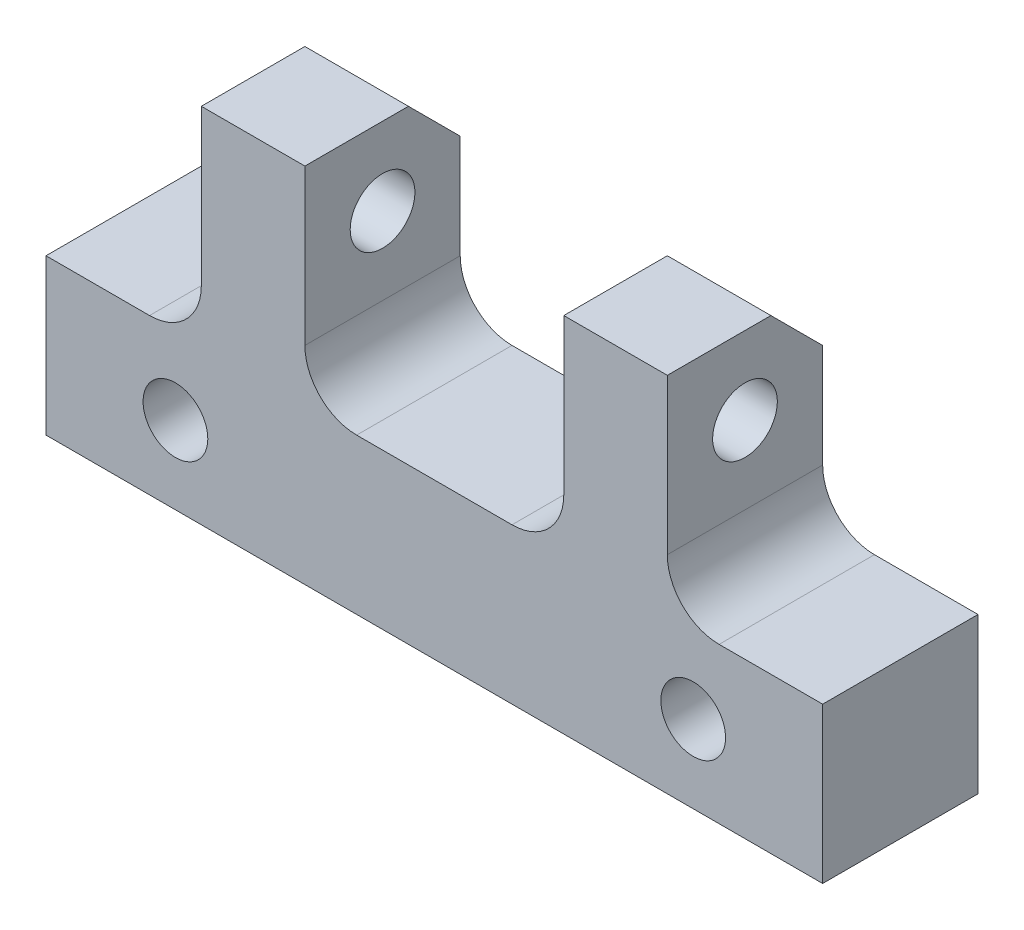
ISO-10303-21;
HEADER;
FILE_DESCRIPTION(('STEP AP214'),'2;1');
FILE_NAME('part.step','',(''),(''),'','','');
FILE_SCHEMA(('AUTOMOTIVE_DESIGN { 1 0 10303 214 1 1 1 1 }'));
ENDSEC;
DATA;
#1=APPLICATION_CONTEXT('core data for automotive mechanical design processes');
#2=APPLICATION_PROTOCOL_DEFINITION('international standard','automotive_design',2000,#1);
#3=PRODUCT_CONTEXT('',#1,'mechanical');
#4=PRODUCT('Part','Part','',(#3));
#5=PRODUCT_RELATED_PRODUCT_CATEGORY('part','',(#4));
#6=PRODUCT_DEFINITION_FORMATION('','',#4);
#7=PRODUCT_DEFINITION_CONTEXT('part definition',#1,'design');
#8=PRODUCT_DEFINITION('design','',#6,#7);
#9=PRODUCT_DEFINITION_SHAPE('','',#8);
#10=(LENGTH_UNIT() NAMED_UNIT(*) SI_UNIT(.MILLI.,.METRE.));
#11=(NAMED_UNIT(*) PLANE_ANGLE_UNIT() SI_UNIT($,.RADIAN.));
#12=(NAMED_UNIT(*) SI_UNIT($,.STERADIAN.) SOLID_ANGLE_UNIT());
#13=UNCERTAINTY_MEASURE_WITH_UNIT(LENGTH_MEASURE(1.E-05),#10,'distance_accuracy_value','');
#14=(GEOMETRIC_REPRESENTATION_CONTEXT(3) GLOBAL_UNCERTAINTY_ASSIGNED_CONTEXT((#13)) GLOBAL_UNIT_ASSIGNED_CONTEXT((#10,
#11,#12)) REPRESENTATION_CONTEXT('',''));
#15=CARTESIAN_POINT('',(0.,0.,0.));
#16=DIRECTION('',(0.,0.,1.));
#17=DIRECTION('',(1.,0.,0.));
#18=AXIS2_PLACEMENT_3D('',#15,#16,#17);
#19=CARTESIAN_POINT('',(0.,0.,6.));
#20=DIRECTION('',(0.,0.,1.));
#21=DIRECTION('',(1.,0.,0.));
#22=AXIS2_PLACEMENT_3D('',#19,#20,#21);
#23=PLANE('',#22);
#24=CARTESIAN_POINT('',(-10.,-3.,6.));
#25=DIRECTION('',(0.,0.,1.));
#26=DIRECTION('',(1.,0.,0.));
#27=AXIS2_PLACEMENT_3D('',#24,#25,#26);
#28=CIRCLE('',#27,1.25);
#29=CARTESIAN_POINT('',(-8.75,-3.,6.));
#30=VERTEX_POINT('',#29);
#31=EDGE_CURVE('E284',#30,#30,#28,.T.);
#32=ORIENTED_EDGE('',*,*,#31,.F.);
#33=EDGE_LOOP('',(#32));
#34=FACE_BOUND('',#33,.T.);
#35=DIRECTION('',(0.,-1.,0.));
#36=VECTOR('',#35,1.);
#37=CARTESIAN_POINT('',(-15.,0.,6.));
#38=LINE('',#37,#36);
#39=CARTESIAN_POINT('',(-15.,0.,6.));
#40=VERTEX_POINT('',#39);
#41=CARTESIAN_POINT('',(-15.,-6.,6.));
#42=VERTEX_POINT('',#41);
#43=EDGE_CURVE('E174',#40,#42,#38,.T.);
#44=ORIENTED_EDGE('',*,*,#43,.T.);
#45=DIRECTION('',(1.,0.,0.));
#46=VECTOR('',#45,1.);
#47=CARTESIAN_POINT('',(-15.,-6.,6.));
#48=LINE('',#47,#46);
#49=CARTESIAN_POINT('',(15.,-6.,6.));
#50=VERTEX_POINT('',#49);
#51=EDGE_CURVE('E164',#42,#50,#48,.T.);
#52=ORIENTED_EDGE('',*,*,#51,.T.);
#53=DIRECTION('',(0.,1.,0.));
#54=VECTOR('',#53,1.);
#55=CARTESIAN_POINT('',(15.,0.,6.));
#56=LINE('',#55,#54);
#57=CARTESIAN_POINT('',(15.,0.,6.));
#58=VERTEX_POINT('',#57);
#59=EDGE_CURVE('E173',#50,#58,#56,.T.);
#60=ORIENTED_EDGE('',*,*,#59,.T.);
#61=DIRECTION('',(-1.,0.,0.));
#62=VECTOR('',#61,1.);
#63=CARTESIAN_POINT('',(9.,0.,6.));
#64=LINE('',#63,#62);
#65=CARTESIAN_POINT('',(11.,0.,6.));
#66=VERTEX_POINT('',#65);
#67=EDGE_CURVE('E318',#58,#66,#64,.T.);
#68=ORIENTED_EDGE('',*,*,#67,.T.);
#69=CARTESIAN_POINT('',(11.,2.,6.));
#70=DIRECTION('',(0.,0.,1.));
#71=DIRECTION('',(1.,0.,0.));
#72=AXIS2_PLACEMENT_3D('',#69,#70,#71);
#73=CIRCLE('',#72,2.);
#74=CARTESIAN_POINT('',(9.,2.,6.));
#75=VERTEX_POINT('',#74);
#76=EDGE_CURVE('E238',#66,#75,#73,.F.);
#77=ORIENTED_EDGE('',*,*,#76,.T.);
#78=DIRECTION('',(0.,1.,0.));
#79=VECTOR('',#78,1.);
#80=CARTESIAN_POINT('',(9.,8.,6.));
#81=LINE('',#80,#79);
#82=CARTESIAN_POINT('',(9.,8.,6.));
#83=VERTEX_POINT('',#82);
#84=EDGE_CURVE('E330',#75,#83,#81,.T.);
#85=ORIENTED_EDGE('',*,*,#84,.T.);
#86=DIRECTION('',(-1.,0.,0.));
#87=VECTOR('',#86,1.);
#88=CARTESIAN_POINT('',(5.,8.,6.));
#89=LINE('',#88,#87);
#90=CARTESIAN_POINT('',(5.,8.,6.));
#91=VERTEX_POINT('',#90);
#92=EDGE_CURVE('E332',#83,#91,#89,.T.);
#93=ORIENTED_EDGE('',*,*,#92,.T.);
#94=DIRECTION('',(0.,-1.,0.));
#95=VECTOR('',#94,1.);
#96=CARTESIAN_POINT('',(5.,8.,6.));
#97=LINE('',#96,#95);
#98=CARTESIAN_POINT('',(5.,2.,6.));
#99=VERTEX_POINT('',#98);
#100=EDGE_CURVE('E274',#91,#99,#97,.T.);
#101=ORIENTED_EDGE('',*,*,#100,.T.);
#102=CARTESIAN_POINT('',(3.,2.,6.));
#103=DIRECTION('',(0.,0.,1.));
#104=DIRECTION('',(1.,0.,0.));
#105=AXIS2_PLACEMENT_3D('',#102,#103,#104);
#106=CIRCLE('',#105,2.);
#107=CARTESIAN_POINT('',(3.,0.,6.));
#108=VERTEX_POINT('',#107);
#109=EDGE_CURVE('E246',#99,#108,#106,.F.);
#110=ORIENTED_EDGE('',*,*,#109,.T.);
#111=DIRECTION('',(-1.,0.,0.));
#112=VECTOR('',#111,1.);
#113=CARTESIAN_POINT('',(5.,0.,6.));
#114=LINE('',#113,#112);
#115=CARTESIAN_POINT('',(-3.,0.,6.));
#116=VERTEX_POINT('',#115);
#117=EDGE_CURVE('E270',#108,#116,#114,.T.);
#118=ORIENTED_EDGE('',*,*,#117,.T.);
#119=CARTESIAN_POINT('',(-3.,2.,6.));
#120=DIRECTION('',(0.,0.,1.));
#121=DIRECTION('',(1.,0.,0.));
#122=AXIS2_PLACEMENT_3D('',#119,#120,#121);
#123=CIRCLE('',#122,2.);
#124=CARTESIAN_POINT('',(-5.,2.,6.));
#125=VERTEX_POINT('',#124);
#126=EDGE_CURVE('E11',#116,#125,#123,.F.);
#127=ORIENTED_EDGE('',*,*,#126,.T.);
#128=DIRECTION('',(0.,1.,0.));
#129=VECTOR('',#128,1.);
#130=CARTESIAN_POINT('',(-5.,0.,6.));
#131=LINE('',#130,#129);
#132=CARTESIAN_POINT('',(-5.,8.,6.));
#133=VERTEX_POINT('',#132);
#134=EDGE_CURVE('E265',#125,#133,#131,.T.);
#135=ORIENTED_EDGE('',*,*,#134,.T.);
#136=DIRECTION('',(-1.,0.,0.));
#137=VECTOR('',#136,1.);
#138=CARTESIAN_POINT('',(-5.,8.,6.));
#139=LINE('',#138,#137);
#140=CARTESIAN_POINT('',(-9.,8.,6.));
#141=VERTEX_POINT('',#140);
#142=EDGE_CURVE('E269',#133,#141,#139,.T.);
#143=ORIENTED_EDGE('',*,*,#142,.T.);
#144=DIRECTION('',(0.,-1.,0.));
#145=VECTOR('',#144,1.);
#146=CARTESIAN_POINT('',(-9.,8.,6.));
#147=LINE('',#146,#145);
#148=CARTESIAN_POINT('',(-9.,2.,6.));
#149=VERTEX_POINT('',#148);
#150=EDGE_CURVE('E272',#141,#149,#147,.T.);
#151=ORIENTED_EDGE('',*,*,#150,.T.);
#152=CARTESIAN_POINT('',(-11.,2.,6.));
#153=DIRECTION('',(0.,0.,1.));
#154=DIRECTION('',(1.,0.,0.));
#155=AXIS2_PLACEMENT_3D('',#152,#153,#154);
#156=CIRCLE('',#155,2.);
#157=CARTESIAN_POINT('',(-11.,0.,6.));
#158=VERTEX_POINT('',#157);
#159=EDGE_CURVE('E242',#149,#158,#156,.F.);
#160=ORIENTED_EDGE('',*,*,#159,.T.);
#161=DIRECTION('',(-1.,0.,0.));
#162=VECTOR('',#161,1.);
#163=CARTESIAN_POINT('',(-9.,0.,6.));
#164=LINE('',#163,#162);
#165=EDGE_CURVE('E179',#158,#40,#164,.T.);
#166=ORIENTED_EDGE('',*,*,#165,.T.);
#167=EDGE_LOOP('',(#44,#52,#60,#68,#77,#85,#93,#101,#110,#118,#127,#135,#143,#151,#160,#166));
#168=FACE_BOUND('',#167,.T.);
#169=CARTESIAN_POINT('',(10.,-3.,6.));
#170=DIRECTION('',(0.,0.,1.));
#171=DIRECTION('',(-1.,0.,0.));
#172=AXIS2_PLACEMENT_3D('',#169,#170,#171);
#173=CIRCLE('',#172,1.25);
#174=CARTESIAN_POINT('',(8.75,-3.,6.));
#175=VERTEX_POINT('',#174);
#176=EDGE_CURVE('E607',#175,#175,#173,.T.);
#177=ORIENTED_EDGE('',*,*,#176,.F.);
#178=EDGE_LOOP('',(#177));
#179=FACE_BOUND('',#178,.T.);
#180=ADVANCED_FACE('F40',(#34,#168,#179),#23,.T.);
#181=CARTESIAN_POINT('',(0.,0.,0.));
#182=DIRECTION('',(0.,0.,1.));
#183=DIRECTION('',(1.,0.,0.));
#184=AXIS2_PLACEMENT_3D('',#181,#182,#183);
#185=PLANE('',#184);
#186=DIRECTION('',(0.,-1.,0.));
#187=VECTOR('',#186,1.);
#188=CARTESIAN_POINT('',(5.,8.,0.));
#189=LINE('',#188,#187);
#190=CARTESIAN_POINT('',(5.,5.99999999999999,0.));
#191=VERTEX_POINT('',#190);
#192=CARTESIAN_POINT('',(5.,2.,0.));
#193=VERTEX_POINT('',#192);
#194=EDGE_CURVE('E260',#191,#193,#189,.T.);
#195=ORIENTED_EDGE('',*,*,#194,.F.);
#196=DIRECTION('',(1.,0.,0.));
#197=VECTOR('',#196,1.);
#198=CARTESIAN_POINT('',(0.,5.99999999999999,0.));
#199=LINE('',#198,#197);
#200=CARTESIAN_POINT('',(9.,6.,0.));
#201=VERTEX_POINT('',#200);
#202=EDGE_CURVE('E201',#191,#201,#199,.T.);
#203=ORIENTED_EDGE('',*,*,#202,.T.);
#204=DIRECTION('',(0.,1.,0.));
#205=VECTOR('',#204,1.);
#206=CARTESIAN_POINT('',(9.,8.,0.));
#207=LINE('',#206,#205);
#208=CARTESIAN_POINT('',(9.,2.,0.));
#209=VERTEX_POINT('',#208);
#210=EDGE_CURVE('E291',#209,#201,#207,.T.);
#211=ORIENTED_EDGE('',*,*,#210,.F.);
#212=CARTESIAN_POINT('',(11.,2.,0.));
#213=DIRECTION('',(0.,0.,1.));
#214=DIRECTION('',(1.,0.,0.));
#215=AXIS2_PLACEMENT_3D('',#212,#213,#214);
#216=CIRCLE('',#215,2.);
#217=CARTESIAN_POINT('',(11.,0.,0.));
#218=VERTEX_POINT('',#217);
#219=EDGE_CURVE('E236',#209,#218,#216,.T.);
#220=ORIENTED_EDGE('',*,*,#219,.T.);
#221=DIRECTION('',(-1.,0.,0.));
#222=VECTOR('',#221,1.);
#223=CARTESIAN_POINT('',(9.,0.,0.));
#224=LINE('',#223,#222);
#225=CARTESIAN_POINT('',(15.,0.,0.));
#226=VERTEX_POINT('',#225);
#227=EDGE_CURVE('E288',#226,#218,#224,.T.);
#228=ORIENTED_EDGE('',*,*,#227,.F.);
#229=DIRECTION('',(0.,1.,0.));
#230=VECTOR('',#229,1.);
#231=CARTESIAN_POINT('',(15.,0.,0.));
#232=LINE('',#231,#230);
#233=CARTESIAN_POINT('',(15.,-6.,0.));
#234=VERTEX_POINT('',#233);
#235=EDGE_CURVE('E286',#234,#226,#232,.T.);
#236=ORIENTED_EDGE('',*,*,#235,.F.);
#237=DIRECTION('',(1.,0.,0.));
#238=VECTOR('',#237,1.);
#239=CARTESIAN_POINT('',(-15.,-6.,0.));
#240=LINE('',#239,#238);
#241=CARTESIAN_POINT('',(-15.,-6.,0.));
#242=VERTEX_POINT('',#241);
#243=EDGE_CURVE('E283',#242,#234,#240,.T.);
#244=ORIENTED_EDGE('',*,*,#243,.F.);
#245=DIRECTION('',(0.,-1.,0.));
#246=VECTOR('',#245,1.);
#247=CARTESIAN_POINT('',(-15.,0.,0.));
#248=LINE('',#247,#246);
#249=CARTESIAN_POINT('',(-15.,0.,0.));
#250=VERTEX_POINT('',#249);
#251=EDGE_CURVE('E187',#250,#242,#248,.T.);
#252=ORIENTED_EDGE('',*,*,#251,.F.);
#253=DIRECTION('',(-1.,0.,0.));
#254=VECTOR('',#253,1.);
#255=CARTESIAN_POINT('',(-9.,0.,0.));
#256=LINE('',#255,#254);
#257=CARTESIAN_POINT('',(-11.,0.,0.));
#258=VERTEX_POINT('',#257);
#259=EDGE_CURVE('E183',#258,#250,#256,.T.);
#260=ORIENTED_EDGE('',*,*,#259,.F.);
#261=CARTESIAN_POINT('',(-11.,2.,0.));
#262=DIRECTION('',(0.,0.,1.));
#263=DIRECTION('',(1.,0.,0.));
#264=AXIS2_PLACEMENT_3D('',#261,#262,#263);
#265=CIRCLE('',#264,2.);
#266=CARTESIAN_POINT('',(-9.,2.,0.));
#267=VERTEX_POINT('',#266);
#268=EDGE_CURVE('E240',#258,#267,#265,.T.);
#269=ORIENTED_EDGE('',*,*,#268,.T.);
#270=DIRECTION('',(0.,-1.,0.));
#271=VECTOR('',#270,1.);
#272=CARTESIAN_POINT('',(-9.,8.,0.));
#273=LINE('',#272,#271);
#274=CARTESIAN_POINT('',(-9.,5.99999999999999,0.));
#275=VERTEX_POINT('',#274);
#276=EDGE_CURVE('E296',#275,#267,#273,.T.);
#277=ORIENTED_EDGE('',*,*,#276,.F.);
#278=DIRECTION('',(1.,0.,0.));
#279=VECTOR('',#278,1.);
#280=CARTESIAN_POINT('',(0.,5.99999999999999,0.));
#281=LINE('',#280,#279);
#282=CARTESIAN_POINT('',(-5.,5.99999999999999,0.));
#283=VERTEX_POINT('',#282);
#284=EDGE_CURVE('E198',#275,#283,#281,.T.);
#285=ORIENTED_EDGE('',*,*,#284,.T.);
#286=DIRECTION('',(0.,1.,0.));
#287=VECTOR('',#286,1.);
#288=CARTESIAN_POINT('',(-5.,0.,0.));
#289=LINE('',#288,#287);
#290=CARTESIAN_POINT('',(-5.,2.,0.));
#291=VERTEX_POINT('',#290);
#292=EDGE_CURVE('E255',#291,#283,#289,.T.);
#293=ORIENTED_EDGE('',*,*,#292,.F.);
#294=CARTESIAN_POINT('',(-3.,2.,0.));
#295=DIRECTION('',(0.,0.,1.));
#296=DIRECTION('',(1.,0.,0.));
#297=AXIS2_PLACEMENT_3D('',#294,#295,#296);
#298=CIRCLE('',#297,2.);
#299=CARTESIAN_POINT('',(-3.,0.,0.));
#300=VERTEX_POINT('',#299);
#301=EDGE_CURVE('E48',#291,#300,#298,.T.);
#302=ORIENTED_EDGE('',*,*,#301,.T.);
#303=DIRECTION('',(-1.,0.,0.));
#304=VECTOR('',#303,1.);
#305=CARTESIAN_POINT('',(5.,0.,0.));
#306=LINE('',#305,#304);
#307=CARTESIAN_POINT('',(3.,0.,0.));
#308=VERTEX_POINT('',#307);
#309=EDGE_CURVE('E254',#308,#300,#306,.T.);
#310=ORIENTED_EDGE('',*,*,#309,.F.);
#311=CARTESIAN_POINT('',(3.,2.,0.));
#312=DIRECTION('',(0.,0.,1.));
#313=DIRECTION('',(1.,0.,0.));
#314=AXIS2_PLACEMENT_3D('',#311,#312,#313);
#315=CIRCLE('',#314,2.);
#316=EDGE_CURVE('E244',#308,#193,#315,.T.);
#317=ORIENTED_EDGE('',*,*,#316,.T.);
#318=EDGE_LOOP('',(#195,#203,#211,#220,#228,#236,#244,#252,#260,#269,#277,#285,#293,#302,#310,#317));
#319=FACE_BOUND('',#318,.T.);
#320=CARTESIAN_POINT('',(-10.,-3.,0.));
#321=DIRECTION('',(0.,0.,1.));
#322=DIRECTION('',(1.,0.,0.));
#323=AXIS2_PLACEMENT_3D('',#320,#321,#322);
#324=CIRCLE('',#323,1.25);
#325=CARTESIAN_POINT('',(-8.75,-3.,0.));
#326=VERTEX_POINT('',#325);
#327=EDGE_CURVE('E604',#326,#326,#324,.T.);
#328=ORIENTED_EDGE('',*,*,#327,.T.);
#329=EDGE_LOOP('',(#328));
#330=FACE_BOUND('',#329,.T.);
#331=CARTESIAN_POINT('',(10.,-3.,0.));
#332=DIRECTION('',(0.,0.,1.));
#333=DIRECTION('',(-1.,0.,0.));
#334=AXIS2_PLACEMENT_3D('',#331,#332,#333);
#335=CIRCLE('',#334,1.25);
#336=CARTESIAN_POINT('',(8.75,-3.,0.));
#337=VERTEX_POINT('',#336);
#338=EDGE_CURVE('E610',#337,#337,#335,.T.);
#339=ORIENTED_EDGE('',*,*,#338,.T.);
#340=EDGE_LOOP('',(#339));
#341=FACE_BOUND('',#340,.T.);
#342=ADVANCED_FACE('F252',(#319,#330,#341),#185,.F.);
#343=CARTESIAN_POINT('',(-15.,0.,6.));
#344=DIRECTION('',(1.,0.,0.));
#345=DIRECTION('',(0.,0.,-1.));
#346=AXIS2_PLACEMENT_3D('',#343,#344,#345);
#347=PLANE('',#346);
#348=ORIENTED_EDGE('',*,*,#251,.T.);
#349=DIRECTION('',(0.,0.,-1.));
#350=VECTOR('',#349,1.);
#351=CARTESIAN_POINT('',(-15.,-6.,6.));
#352=LINE('',#351,#350);
#353=EDGE_CURVE('E168',#42,#242,#352,.T.);
#354=ORIENTED_EDGE('',*,*,#353,.F.);
#355=ORIENTED_EDGE('',*,*,#43,.F.);
#356=DIRECTION('',(0.,0.,-1.));
#357=VECTOR('',#356,1.);
#358=CARTESIAN_POINT('',(-15.,0.,6.));
#359=LINE('',#358,#357);
#360=EDGE_CURVE('E281',#40,#250,#359,.T.);
#361=ORIENTED_EDGE('',*,*,#360,.T.);
#362=EDGE_LOOP('',(#348,#354,#355,#361));
#363=FACE_BOUND('',#362,.T.);
#364=ADVANCED_FACE('F185',(#363),#347,.F.);
#365=CARTESIAN_POINT('',(-15.,-6.,6.));
#366=DIRECTION('',(0.,1.,0.));
#367=DIRECTION('',(-1.,0.,0.));
#368=AXIS2_PLACEMENT_3D('',#365,#366,#367);
#369=PLANE('',#368);
#370=ORIENTED_EDGE('',*,*,#243,.T.);
#371=DIRECTION('',(0.,0.,-1.));
#372=VECTOR('',#371,1.);
#373=CARTESIAN_POINT('',(15.,-6.,6.));
#374=LINE('',#373,#372);
#375=EDGE_CURVE('E171',#50,#234,#374,.T.);
#376=ORIENTED_EDGE('',*,*,#375,.F.);
#377=ORIENTED_EDGE('',*,*,#51,.F.);
#378=ORIENTED_EDGE('',*,*,#353,.T.);
#379=EDGE_LOOP('',(#370,#376,#377,#378));
#380=FACE_BOUND('',#379,.T.);
#381=ADVANCED_FACE('F166',(#380),#369,.F.);
#382=CARTESIAN_POINT('',(15.,0.,6.));
#383=DIRECTION('',(-1.,0.,0.));
#384=DIRECTION('',(0.,-1.,0.));
#385=AXIS2_PLACEMENT_3D('',#382,#383,#384);
#386=PLANE('',#385);
#387=ORIENTED_EDGE('',*,*,#235,.T.);
#388=DIRECTION('',(0.,0.,-1.));
#389=VECTOR('',#388,1.);
#390=CARTESIAN_POINT('',(15.,0.,6.));
#391=LINE('',#390,#389);
#392=EDGE_CURVE('E193',#58,#226,#391,.T.);
#393=ORIENTED_EDGE('',*,*,#392,.F.);
#394=ORIENTED_EDGE('',*,*,#59,.F.);
#395=ORIENTED_EDGE('',*,*,#375,.T.);
#396=EDGE_LOOP('',(#387,#393,#394,#395));
#397=FACE_BOUND('',#396,.T.);
#398=ADVANCED_FACE('F549',(#397),#386,.F.);
#399=CARTESIAN_POINT('',(9.,0.,6.));
#400=DIRECTION('',(0.,-1.,0.));
#401=DIRECTION('',(1.,0.,0.));
#402=AXIS2_PLACEMENT_3D('',#399,#400,#401);
#403=PLANE('',#402);
#404=ORIENTED_EDGE('',*,*,#227,.T.);
#405=DIRECTION('',(0.,0.,-1.));
#406=VECTOR('',#405,1.);
#407=CARTESIAN_POINT('',(11.,0.,6.));
#408=LINE('',#407,#406);
#409=EDGE_CURVE('E220',#218,#66,#408,.F.);
#410=ORIENTED_EDGE('',*,*,#409,.T.);
#411=ORIENTED_EDGE('',*,*,#67,.F.);
#412=ORIENTED_EDGE('',*,*,#392,.T.);
#413=EDGE_LOOP('',(#404,#410,#411,#412));
#414=FACE_BOUND('',#413,.T.);
#415=ADVANCED_FACE('F315',(#414),#403,.F.);
#416=CARTESIAN_POINT('',(9.,8.,6.));
#417=DIRECTION('',(-1.,0.,0.));
#418=DIRECTION('',(0.,-1.,0.));
#419=AXIS2_PLACEMENT_3D('',#416,#417,#418);
#420=PLANE('',#419);
#421=CARTESIAN_POINT('',(9.,5.,3.));
#422=DIRECTION('',(-1.,0.,0.));
#423=DIRECTION('',(0.,-1.,0.));
#424=AXIS2_PLACEMENT_3D('',#421,#422,#423);
#425=CIRCLE('',#424,1.25);
#426=CARTESIAN_POINT('',(9.,3.75,3.));
#427=VERTEX_POINT('',#426);
#428=EDGE_CURVE('E613',#427,#427,#425,.T.);
#429=ORIENTED_EDGE('',*,*,#428,.T.);
#430=EDGE_LOOP('',(#429));
#431=FACE_BOUND('',#430,.T.);
#432=ORIENTED_EDGE('',*,*,#84,.F.);
#433=DIRECTION('',(0.,0.,-1.));
#434=VECTOR('',#433,1.);
#435=CARTESIAN_POINT('',(9.,2.,0.));
#436=LINE('',#435,#434);
#437=EDGE_CURVE('E213',#75,#209,#436,.T.);
#438=ORIENTED_EDGE('',*,*,#437,.T.);
#439=ORIENTED_EDGE('',*,*,#210,.T.);
#440=DIRECTION('',(0.,-0.707106781186549,-0.707106781186546));
#441=VECTOR('',#440,1.);
#442=CARTESIAN_POINT('',(9.,8.,2.));
#443=LINE('',#442,#441);
#444=CARTESIAN_POINT('',(9.,8.,2.));
#445=VERTEX_POINT('',#444);
#446=EDGE_CURVE('E204',#201,#445,#443,.F.);
#447=ORIENTED_EDGE('',*,*,#446,.T.);
#448=DIRECTION('',(0.,0.,-1.));
#449=VECTOR('',#448,1.);
#450=CARTESIAN_POINT('',(9.,8.,6.));
#451=LINE('',#450,#449);
#452=EDGE_CURVE('E308',#83,#445,#451,.T.);
#453=ORIENTED_EDGE('',*,*,#452,.F.);
#454=EDGE_LOOP('',(#432,#438,#439,#447,#453));
#455=FACE_BOUND('',#454,.T.);
#456=ADVANCED_FACE('F328',(#431,#455),#420,.F.);
#457=CARTESIAN_POINT('',(5.,8.,6.));
#458=DIRECTION('',(0.,-1.,0.));
#459=DIRECTION('',(1.,0.,0.));
#460=AXIS2_PLACEMENT_3D('',#457,#458,#459);
#461=PLANE('',#460);
#462=ORIENTED_EDGE('',*,*,#452,.T.);
#463=DIRECTION('',(-1.,0.,0.));
#464=VECTOR('',#463,1.);
#465=CARTESIAN_POINT('',(5.,8.,2.));
#466=LINE('',#465,#464);
#467=CARTESIAN_POINT('',(5.,8.,2.));
#468=VERTEX_POINT('',#467);
#469=EDGE_CURVE('E188',#445,#468,#466,.T.);
#470=ORIENTED_EDGE('',*,*,#469,.T.);
#471=DIRECTION('',(0.,0.,-1.));
#472=VECTOR('',#471,1.);
#473=CARTESIAN_POINT('',(5.,8.,6.));
#474=LINE('',#473,#472);
#475=EDGE_CURVE('E305',#91,#468,#474,.T.);
#476=ORIENTED_EDGE('',*,*,#475,.F.);
#477=ORIENTED_EDGE('',*,*,#92,.F.);
#478=EDGE_LOOP('',(#462,#470,#476,#477));
#479=FACE_BOUND('',#478,.T.);
#480=ADVANCED_FACE('F352',(#479),#461,.F.);
#481=CARTESIAN_POINT('',(5.,8.,6.));
#482=DIRECTION('',(1.,0.,0.));
#483=DIRECTION('',(0.,0.,-1.));
#484=AXIS2_PLACEMENT_3D('',#481,#482,#483);
#485=PLANE('',#484);
#486=CARTESIAN_POINT('',(5.,5.,3.));
#487=DIRECTION('',(1.,0.,0.));
#488=DIRECTION('',(0.,0.,-1.));
#489=AXIS2_PLACEMENT_3D('',#486,#487,#488);
#490=CIRCLE('',#489,1.25);
#491=CARTESIAN_POINT('',(5.,5.,1.75));
#492=VERTEX_POINT('',#491);
#493=EDGE_CURVE('E618',#492,#492,#490,.T.);
#494=ORIENTED_EDGE('',*,*,#493,.T.);
#495=EDGE_LOOP('',(#494));
#496=FACE_BOUND('',#495,.T.);
#497=ORIENTED_EDGE('',*,*,#194,.T.);
#498=DIRECTION('',(0.,0.,-1.));
#499=VECTOR('',#498,1.);
#500=CARTESIAN_POINT('',(5.,2.,6.));
#501=LINE('',#500,#499);
#502=EDGE_CURVE('E232',#193,#99,#501,.F.);
#503=ORIENTED_EDGE('',*,*,#502,.T.);
#504=ORIENTED_EDGE('',*,*,#100,.F.);
#505=ORIENTED_EDGE('',*,*,#475,.T.);
#506=DIRECTION('',(0.,0.707106781186549,0.707106781186546));
#507=VECTOR('',#506,1.);
#508=CARTESIAN_POINT('',(5.,8.,2.));
#509=LINE('',#508,#507);
#510=EDGE_CURVE('E191',#468,#191,#509,.F.);
#511=ORIENTED_EDGE('',*,*,#510,.T.);
#512=EDGE_LOOP('',(#497,#503,#504,#505,#511));
#513=FACE_BOUND('',#512,.T.);
#514=ADVANCED_FACE('F346',(#496,#513),#485,.F.);
#515=CARTESIAN_POINT('',(5.,0.,6.));
#516=DIRECTION('',(0.,-1.,0.));
#517=DIRECTION('',(1.,0.,0.));
#518=AXIS2_PLACEMENT_3D('',#515,#516,#517);
#519=PLANE('',#518);
#520=ORIENTED_EDGE('',*,*,#117,.F.);
#521=DIRECTION('',(0.,0.,-1.));
#522=VECTOR('',#521,1.);
#523=CARTESIAN_POINT('',(3.,0.,0.));
#524=LINE('',#523,#522);
#525=EDGE_CURVE('E229',#108,#308,#524,.T.);
#526=ORIENTED_EDGE('',*,*,#525,.T.);
#527=ORIENTED_EDGE('',*,*,#309,.T.);
#528=DIRECTION('',(0.,0.,-1.));
#529=VECTOR('',#528,1.);
#530=CARTESIAN_POINT('',(-3.,0.,6.));
#531=LINE('',#530,#529);
#532=EDGE_CURVE('E227',#300,#116,#531,.F.);
#533=ORIENTED_EDGE('',*,*,#532,.T.);
#534=EDGE_LOOP('',(#520,#526,#527,#533));
#535=FACE_BOUND('',#534,.T.);
#536=ADVANCED_FACE('F258',(#535),#519,.F.);
#537=CARTESIAN_POINT('',(-5.,0.,6.));
#538=DIRECTION('',(-1.,0.,0.));
#539=DIRECTION('',(0.,-1.,0.));
#540=AXIS2_PLACEMENT_3D('',#537,#538,#539);
#541=PLANE('',#540);
#542=CARTESIAN_POINT('',(-5.,5.,3.));
#543=DIRECTION('',(-1.,0.,0.));
#544=DIRECTION('',(0.,-1.,0.));
#545=AXIS2_PLACEMENT_3D('',#542,#543,#544);
#546=CIRCLE('',#545,1.25);
#547=CARTESIAN_POINT('',(-5.,3.75,3.));
#548=VERTEX_POINT('',#547);
#549=EDGE_CURVE('E217',#548,#548,#546,.T.);
#550=ORIENTED_EDGE('',*,*,#549,.T.);
#551=EDGE_LOOP('',(#550));
#552=FACE_BOUND('',#551,.T.);
#553=ORIENTED_EDGE('',*,*,#134,.F.);
#554=DIRECTION('',(0.,0.,-1.));
#555=VECTOR('',#554,1.);
#556=CARTESIAN_POINT('',(-5.,2.,0.));
#557=LINE('',#556,#555);
#558=EDGE_CURVE('E234',#125,#291,#557,.T.);
#559=ORIENTED_EDGE('',*,*,#558,.T.);
#560=ORIENTED_EDGE('',*,*,#292,.T.);
#561=DIRECTION('',(0.,-0.707106781186549,-0.707106781186546));
#562=VECTOR('',#561,1.);
#563=CARTESIAN_POINT('',(-5.,8.,2.));
#564=LINE('',#563,#562);
#565=CARTESIAN_POINT('',(-5.,8.,2.));
#566=VERTEX_POINT('',#565);
#567=EDGE_CURVE('E211',#283,#566,#564,.F.);
#568=ORIENTED_EDGE('',*,*,#567,.T.);
#569=DIRECTION('',(0.,0.,-1.));
#570=VECTOR('',#569,1.);
#571=CARTESIAN_POINT('',(-5.,8.,6.));
#572=LINE('',#571,#570);
#573=EDGE_CURVE('E267',#133,#566,#572,.T.);
#574=ORIENTED_EDGE('',*,*,#573,.F.);
#575=EDGE_LOOP('',(#553,#559,#560,#568,#574));
#576=FACE_BOUND('',#575,.T.);
#577=ADVANCED_FACE('F263',(#552,#576),#541,.F.);
#578=CARTESIAN_POINT('',(-5.,8.,6.));
#579=DIRECTION('',(0.,-1.,0.));
#580=DIRECTION('',(1.,0.,0.));
#581=AXIS2_PLACEMENT_3D('',#578,#579,#580);
#582=PLANE('',#581);
#583=ORIENTED_EDGE('',*,*,#573,.T.);
#584=DIRECTION('',(-1.,0.,0.));
#585=VECTOR('',#584,1.);
#586=CARTESIAN_POINT('',(-5.,8.,2.));
#587=LINE('',#586,#585);
#588=CARTESIAN_POINT('',(-9.,8.,2.));
#589=VERTEX_POINT('',#588);
#590=EDGE_CURVE('E206',#566,#589,#587,.T.);
#591=ORIENTED_EDGE('',*,*,#590,.T.);
#592=DIRECTION('',(0.,0.,-1.));
#593=VECTOR('',#592,1.);
#594=CARTESIAN_POINT('',(-9.,8.,6.));
#595=LINE('',#594,#593);
#596=EDGE_CURVE('E301',#141,#589,#595,.T.);
#597=ORIENTED_EDGE('',*,*,#596,.F.);
#598=ORIENTED_EDGE('',*,*,#142,.F.);
#599=EDGE_LOOP('',(#583,#591,#597,#598));
#600=FACE_BOUND('',#599,.T.);
#601=ADVANCED_FACE('F382',(#600),#582,.F.);
#602=CARTESIAN_POINT('',(-9.,8.,6.));
#603=DIRECTION('',(1.,0.,0.));
#604=DIRECTION('',(0.,1.,0.));
#605=AXIS2_PLACEMENT_3D('',#602,#603,#604);
#606=PLANE('',#605);
#607=CARTESIAN_POINT('',(-9.,5.,3.));
#608=DIRECTION('',(1.,0.,0.));
#609=DIRECTION('',(0.,1.,0.));
#610=AXIS2_PLACEMENT_3D('',#607,#608,#609);
#611=CIRCLE('',#610,1.25);
#612=CARTESIAN_POINT('',(-9.,6.25,3.));
#613=VERTEX_POINT('',#612);
#614=EDGE_CURVE('E214',#613,#613,#611,.T.);
#615=ORIENTED_EDGE('',*,*,#614,.T.);
#616=EDGE_LOOP('',(#615));
#617=FACE_BOUND('',#616,.T.);
#618=ORIENTED_EDGE('',*,*,#276,.T.);
#619=DIRECTION('',(0.,0.,-1.));
#620=VECTOR('',#619,1.);
#621=CARTESIAN_POINT('',(-9.,2.,6.));
#622=LINE('',#621,#620);
#623=EDGE_CURVE('E225',#267,#149,#622,.F.);
#624=ORIENTED_EDGE('',*,*,#623,.T.);
#625=ORIENTED_EDGE('',*,*,#150,.F.);
#626=ORIENTED_EDGE('',*,*,#596,.T.);
#627=DIRECTION('',(0.,0.707106781186549,0.707106781186546));
#628=VECTOR('',#627,1.);
#629=CARTESIAN_POINT('',(-9.,8.,2.));
#630=LINE('',#629,#628);
#631=EDGE_CURVE('E209',#589,#275,#630,.F.);
#632=ORIENTED_EDGE('',*,*,#631,.T.);
#633=EDGE_LOOP('',(#618,#624,#625,#626,#632));
#634=FACE_BOUND('',#633,.T.);
#635=ADVANCED_FACE('F378',(#617,#634),#606,.F.);
#636=CARTESIAN_POINT('',(-9.,0.,6.));
#637=DIRECTION('',(0.,-1.,0.));
#638=DIRECTION('',(1.,0.,0.));
#639=AXIS2_PLACEMENT_3D('',#636,#637,#638);
#640=PLANE('',#639);
#641=ORIENTED_EDGE('',*,*,#165,.F.);
#642=DIRECTION('',(0.,0.,-1.));
#643=VECTOR('',#642,1.);
#644=CARTESIAN_POINT('',(-11.,0.,0.));
#645=LINE('',#644,#643);
#646=EDGE_CURVE('E222',#158,#258,#645,.T.);
#647=ORIENTED_EDGE('',*,*,#646,.T.);
#648=ORIENTED_EDGE('',*,*,#259,.T.);
#649=ORIENTED_EDGE('',*,*,#360,.F.);
#650=EDGE_LOOP('',(#641,#647,#648,#649));
#651=FACE_BOUND('',#650,.T.);
#652=ADVANCED_FACE('F375',(#651),#640,.F.);
#653=CARTESIAN_POINT('',(-10.,-3.,6.));
#654=DIRECTION('',(0.,0.,-1.));
#655=DIRECTION('',(-1.,0.,0.));
#656=AXIS2_PLACEMENT_3D('',#653,#654,#655);
#657=CYLINDRICAL_SURFACE('',#656,1.25);
#658=ORIENTED_EDGE('',*,*,#31,.T.);
#659=EDGE_LOOP('',(#658));
#660=FACE_BOUND('',#659,.T.);
#661=ORIENTED_EDGE('',*,*,#327,.F.);
#662=EDGE_LOOP('',(#661));
#663=FACE_BOUND('',#662,.T.);
#664=ADVANCED_FACE('F372',(#660,#663),#657,.F.);
#665=CARTESIAN_POINT('',(10.,-3.,6.));
#666=DIRECTION('',(0.,0.,-1.));
#667=DIRECTION('',(-1.,0.,0.));
#668=AXIS2_PLACEMENT_3D('',#665,#666,#667);
#669=CYLINDRICAL_SURFACE('',#668,1.25);
#670=ORIENTED_EDGE('',*,*,#176,.T.);
#671=EDGE_LOOP('',(#670));
#672=FACE_BOUND('',#671,.T.);
#673=ORIENTED_EDGE('',*,*,#338,.F.);
#674=EDGE_LOOP('',(#673));
#675=FACE_BOUND('',#674,.T.);
#676=ADVANCED_FACE('F419',(#672,#675),#669,.F.);
#677=CARTESIAN_POINT('',(5.,8.,2.));
#678=DIRECTION('',(0.,-0.707106781186546,0.707106781186549));
#679=DIRECTION('',(-1.,0.,0.));
#680=AXIS2_PLACEMENT_3D('',#677,#678,#679);
#681=PLANE('',#680);
#682=ORIENTED_EDGE('',*,*,#446,.F.);
#683=ORIENTED_EDGE('',*,*,#202,.F.);
#684=ORIENTED_EDGE('',*,*,#510,.F.);
#685=ORIENTED_EDGE('',*,*,#469,.F.);
#686=EDGE_LOOP('',(#682,#683,#684,#685));
#687=FACE_BOUND('',#686,.T.);
#688=ADVANCED_FACE('F350',(#687),#681,.F.);
#689=CARTESIAN_POINT('',(-5.,8.,2.));
#690=DIRECTION('',(0.,-0.707106781186546,0.707106781186549));
#691=DIRECTION('',(-1.,0.,0.));
#692=AXIS2_PLACEMENT_3D('',#689,#690,#691);
#693=PLANE('',#692);
#694=ORIENTED_EDGE('',*,*,#567,.F.);
#695=ORIENTED_EDGE('',*,*,#284,.F.);
#696=ORIENTED_EDGE('',*,*,#631,.F.);
#697=ORIENTED_EDGE('',*,*,#590,.F.);
#698=EDGE_LOOP('',(#694,#695,#696,#697));
#699=FACE_BOUND('',#698,.T.);
#700=ADVANCED_FACE('F433',(#699),#693,.F.);
#701=CARTESIAN_POINT('',(-15.,5.,3.));
#702=DIRECTION('',(1.,0.,0.));
#703=DIRECTION('',(0.,0.,-1.));
#704=AXIS2_PLACEMENT_3D('',#701,#702,#703);
#705=CYLINDRICAL_SURFACE('',#704,1.25);
#706=ORIENTED_EDGE('',*,*,#614,.F.);
#707=EDGE_LOOP('',(#706));
#708=FACE_BOUND('',#707,.T.);
#709=ORIENTED_EDGE('',*,*,#549,.F.);
#710=EDGE_LOOP('',(#709));
#711=FACE_BOUND('',#710,.T.);
#712=ADVANCED_FACE('F440',(#708,#711),#705,.F.);
#713=ORIENTED_EDGE('',*,*,#493,.F.);
#714=EDGE_LOOP('',(#713));
#715=FACE_BOUND('',#714,.T.);
#716=ORIENTED_EDGE('',*,*,#428,.F.);
#717=EDGE_LOOP('',(#716));
#718=FACE_BOUND('',#717,.T.);
#719=ADVANCED_FACE('F449',(#715,#718),#705,.F.);
#720=CARTESIAN_POINT('',(11.,2.,6.));
#721=DIRECTION('',(0.,0.,1.));
#722=DIRECTION('',(1.,0.,0.));
#723=AXIS2_PLACEMENT_3D('',#720,#721,#722);
#724=CYLINDRICAL_SURFACE('',#723,2.);
#725=ORIENTED_EDGE('',*,*,#76,.F.);
#726=ORIENTED_EDGE('',*,*,#409,.F.);
#727=ORIENTED_EDGE('',*,*,#219,.F.);
#728=ORIENTED_EDGE('',*,*,#437,.F.);
#729=EDGE_LOOP('',(#725,#726,#727,#728));
#730=FACE_BOUND('',#729,.T.);
#731=ADVANCED_FACE('F325',(#730),#724,.F.);
#732=CARTESIAN_POINT('',(-11.,2.,6.));
#733=DIRECTION('',(0.,0.,1.));
#734=DIRECTION('',(1.,0.,0.));
#735=AXIS2_PLACEMENT_3D('',#732,#733,#734);
#736=CYLINDRICAL_SURFACE('',#735,2.);
#737=ORIENTED_EDGE('',*,*,#159,.F.);
#738=ORIENTED_EDGE('',*,*,#623,.F.);
#739=ORIENTED_EDGE('',*,*,#268,.F.);
#740=ORIENTED_EDGE('',*,*,#646,.F.);
#741=EDGE_LOOP('',(#737,#738,#739,#740));
#742=FACE_BOUND('',#741,.T.);
#743=ADVANCED_FACE('F463',(#742),#736,.F.);
#744=CARTESIAN_POINT('',(3.,2.,6.));
#745=DIRECTION('',(0.,0.,1.));
#746=DIRECTION('',(1.,0.,0.));
#747=AXIS2_PLACEMENT_3D('',#744,#745,#746);
#748=CYLINDRICAL_SURFACE('',#747,2.);
#749=ORIENTED_EDGE('',*,*,#109,.F.);
#750=ORIENTED_EDGE('',*,*,#502,.F.);
#751=ORIENTED_EDGE('',*,*,#316,.F.);
#752=ORIENTED_EDGE('',*,*,#525,.F.);
#753=EDGE_LOOP('',(#749,#750,#751,#752));
#754=FACE_BOUND('',#753,.T.);
#755=ADVANCED_FACE('F344',(#754),#748,.F.);
#756=CARTESIAN_POINT('',(-3.,2.,6.));
#757=DIRECTION('',(0.,0.,1.));
#758=DIRECTION('',(1.,0.,0.));
#759=AXIS2_PLACEMENT_3D('',#756,#757,#758);
#760=CYLINDRICAL_SURFACE('',#759,2.);
#761=ORIENTED_EDGE('',*,*,#126,.F.);
#762=ORIENTED_EDGE('',*,*,#532,.F.);
#763=ORIENTED_EDGE('',*,*,#301,.F.);
#764=ORIENTED_EDGE('',*,*,#558,.F.);
#765=EDGE_LOOP('',(#761,#762,#763,#764));
#766=FACE_BOUND('',#765,.T.);
#767=ADVANCED_FACE('F42',(#766),#760,.F.);
#768=CLOSED_SHELL('',(#180,#342,#364,#381,#398,#415,#456,#480,#514,#536,#577,#601,#635,#652,
#664,#676,#688,#700,#712,#719,#731,#743,#755,#767));
#769=MANIFOLD_SOLID_BREP('B2',#768);
#770=ADVANCED_BREP_SHAPE_REPRESENTATION('',(#18,#769),#14);
#771=SHAPE_DEFINITION_REPRESENTATION(#9,#770);
ENDSEC;
END-ISO-10303-21;
